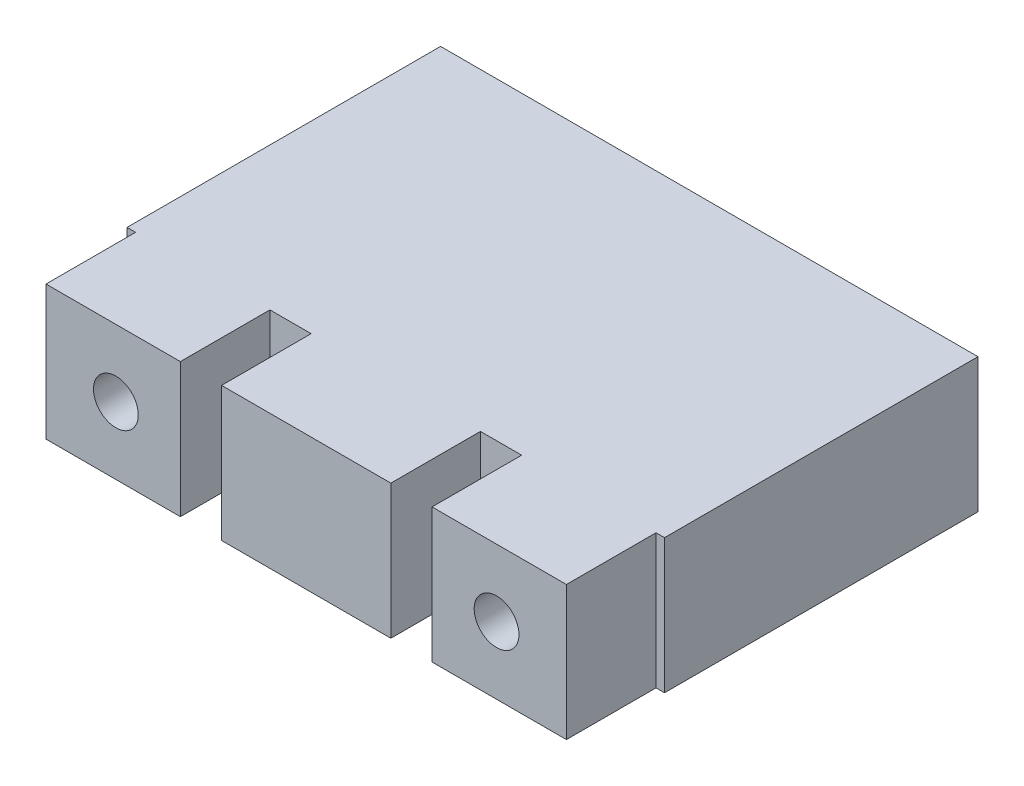
ISO-10303-21;
HEADER;
FILE_DESCRIPTION(('STEP AP214'),'2;1');
FILE_NAME('part.step','',(''),(''),'','','');
FILE_SCHEMA(('AUTOMOTIVE_DESIGN { 1 0 10303 214 1 1 1 1 }'));
ENDSEC;
DATA;
#1=APPLICATION_CONTEXT('core data for automotive mechanical design processes');
#2=APPLICATION_PROTOCOL_DEFINITION('international standard','automotive_design',2000,#1);
#3=PRODUCT_CONTEXT('',#1,'mechanical');
#4=PRODUCT('Part','Part','',(#3));
#5=PRODUCT_RELATED_PRODUCT_CATEGORY('part','',(#4));
#6=PRODUCT_DEFINITION_FORMATION('','',#4);
#7=PRODUCT_DEFINITION_CONTEXT('part definition',#1,'design');
#8=PRODUCT_DEFINITION('design','',#6,#7);
#9=PRODUCT_DEFINITION_SHAPE('','',#8);
#10=(LENGTH_UNIT() NAMED_UNIT(*) SI_UNIT(.MILLI.,.METRE.));
#11=(NAMED_UNIT(*) PLANE_ANGLE_UNIT() SI_UNIT($,.RADIAN.));
#12=(NAMED_UNIT(*) SI_UNIT($,.STERADIAN.) SOLID_ANGLE_UNIT());
#13=UNCERTAINTY_MEASURE_WITH_UNIT(LENGTH_MEASURE(1.E-05),#10,'distance_accuracy_value','');
#14=(GEOMETRIC_REPRESENTATION_CONTEXT(3) GLOBAL_UNCERTAINTY_ASSIGNED_CONTEXT((#13)) GLOBAL_UNIT_ASSIGNED_CONTEXT((#10,
#11,#12)) REPRESENTATION_CONTEXT('',''));
#15=CARTESIAN_POINT('',(0.,0.,0.));
#16=DIRECTION('',(0.,0.,1.));
#17=DIRECTION('',(1.,0.,0.));
#18=AXIS2_PLACEMENT_3D('',#15,#16,#17);
#19=CARTESIAN_POINT('',(0.,0.,-6.35));
#20=DIRECTION('',(0.,0.,1.));
#21=DIRECTION('',(1.,0.,0.));
#22=AXIS2_PLACEMENT_3D('',#19,#20,#21);
#23=PLANE('',#22);
#24=DIRECTION('',(1.,0.,0.));
#25=VECTOR('',#24,1.);
#26=CARTESIAN_POINT('',(-13.04925,9.525,-6.35));
#27=LINE('',#26,#25);
#28=CARTESIAN_POINT('',(24.4475,9.525,-6.35));
#29=VERTEX_POINT('',#28);
#30=CARTESIAN_POINT('',(25.05075,9.525,-6.35));
#31=VERTEX_POINT('',#30);
#32=EDGE_CURVE('E256',#29,#31,#27,.T.);
#33=ORIENTED_EDGE('',*,*,#32,.F.);
#34=DIRECTION('',(0.,1.,0.));
#35=VECTOR('',#34,1.);
#36=CARTESIAN_POINT('',(24.4475,9.525,-6.34999999999764));
#37=LINE('',#36,#35);
#38=CARTESIAN_POINT('',(24.4475,0.,-6.35000000011132));
#39=VERTEX_POINT('',#38);
#40=EDGE_CURVE('E204',#39,#29,#37,.T.);
#41=ORIENTED_EDGE('',*,*,#40,.F.);
#42=DIRECTION('',(-1.,0.,0.));
#43=VECTOR('',#42,1.);
#44=CARTESIAN_POINT('',(-13.04925,0.,-6.35));
#45=LINE('',#44,#43);
#46=CARTESIAN_POINT('',(25.05075,0.,-6.35));
#47=VERTEX_POINT('',#46);
#48=EDGE_CURVE('E247',#47,#39,#45,.T.);
#49=ORIENTED_EDGE('',*,*,#48,.F.);
#50=DIRECTION('',(0.,-1.,0.));
#51=VECTOR('',#50,1.);
#52=CARTESIAN_POINT('',(25.05075,9.525,-6.35));
#53=LINE('',#52,#51);
#54=EDGE_CURVE('E259',#31,#47,#53,.T.);
#55=ORIENTED_EDGE('',*,*,#54,.F.);
#56=EDGE_LOOP('',(#33,#41,#49,#55));
#57=FACE_BOUND('',#56,.T.);
#58=ADVANCED_FACE('F63',(#57),#23,.T.);
#59=DIRECTION('',(0.,1.,0.));
#60=VECTOR('',#59,1.);
#61=CARTESIAN_POINT('',(-12.446,9.525,-6.34999999999764));
#62=LINE('',#61,#60);
#63=CARTESIAN_POINT('',(-12.446,0.,-6.35));
#64=VERTEX_POINT('',#63);
#65=CARTESIAN_POINT('',(-12.446,9.525,-6.35000000011132));
#66=VERTEX_POINT('',#65);
#67=EDGE_CURVE('E211',#64,#66,#62,.T.);
#68=ORIENTED_EDGE('',*,*,#67,.T.);
#69=CARTESIAN_POINT('',(-13.04925,9.525,-6.35));
#70=VERTEX_POINT('',#69);
#71=EDGE_CURVE('E268',#70,#66,#27,.T.);
#72=ORIENTED_EDGE('',*,*,#71,.F.);
#73=DIRECTION('',(0.,1.,0.));
#74=VECTOR('',#73,1.);
#75=CARTESIAN_POINT('',(-13.04925,9.525,-6.35));
#76=LINE('',#75,#74);
#77=CARTESIAN_POINT('',(-13.04925,0.,-6.35));
#78=VERTEX_POINT('',#77);
#79=EDGE_CURVE('E220',#78,#70,#76,.T.);
#80=ORIENTED_EDGE('',*,*,#79,.F.);
#81=EDGE_CURVE('E276',#64,#78,#45,.T.);
#82=ORIENTED_EDGE('',*,*,#81,.F.);
#83=EDGE_LOOP('',(#68,#72,#80,#82));
#84=FACE_BOUND('',#83,.T.);
#85=ADVANCED_FACE('F308',(#84),#23,.T.);
#86=CARTESIAN_POINT('',(0.,9.525,-6.35));
#87=DIRECTION('',(0.,-1.,0.));
#88=DIRECTION('',(0.,0.,-1.));
#89=AXIS2_PLACEMENT_3D('',#86,#87,#88);
#90=PLANE('',#89);
#91=DIRECTION('',(1.,0.,0.));
#92=VECTOR('',#91,1.);
#93=CARTESIAN_POINT('',(0.,9.525,0.));
#94=LINE('',#93,#92);
#95=CARTESIAN_POINT('',(0.,9.525,0.));
#96=VERTEX_POINT('',#95);
#97=CARTESIAN_POINT('',(12.0015,9.525,0.));
#98=VERTEX_POINT('',#97);
#99=EDGE_CURVE('E291',#96,#98,#94,.T.);
#100=ORIENTED_EDGE('',*,*,#99,.T.);
#101=DIRECTION('',(0.,0.,1.));
#102=VECTOR('',#101,1.);
#103=CARTESIAN_POINT('',(12.0015,9.525,-6.35));
#104=LINE('',#103,#102);
#105=CARTESIAN_POINT('',(12.0015,9.525,-6.35));
#106=VERTEX_POINT('',#105);
#107=EDGE_CURVE('E71',#106,#98,#104,.T.);
#108=ORIENTED_EDGE('',*,*,#107,.F.);
#109=CARTESIAN_POINT('',(14.9225,9.525,-6.35000000011132));
#110=VERTEX_POINT('',#109);
#111=EDGE_CURVE('E180',#106,#110,#27,.T.);
#112=ORIENTED_EDGE('',*,*,#111,.T.);
#113=DIRECTION('',(0.,0.,1.));
#114=VECTOR('',#113,1.);
#115=CARTESIAN_POINT('',(14.9225,9.525,-500000.));
#116=LINE('',#115,#114);
#117=CARTESIAN_POINT('',(14.9225,9.525,0.));
#118=VERTEX_POINT('',#117);
#119=EDGE_CURVE('E174',#110,#118,#116,.T.);
#120=ORIENTED_EDGE('',*,*,#119,.T.);
#121=DIRECTION('',(1.,0.,0.));
#122=VECTOR('',#121,1.);
#123=CARTESIAN_POINT('',(14.9225,9.525,0.));
#124=LINE('',#123,#122);
#125=CARTESIAN_POINT('',(24.4475,9.525,0.));
#126=VERTEX_POINT('',#125);
#127=EDGE_CURVE('E177',#118,#126,#124,.T.);
#128=ORIENTED_EDGE('',*,*,#127,.T.);
#129=DIRECTION('',(0.,0.,1.));
#130=VECTOR('',#129,1.);
#131=CARTESIAN_POINT('',(24.4475,9.525,-500000.));
#132=LINE('',#131,#130);
#133=EDGE_CURVE('E78',#29,#126,#132,.T.);
#134=ORIENTED_EDGE('',*,*,#133,.F.);
#135=ORIENTED_EDGE('',*,*,#32,.T.);
#136=DIRECTION('',(0.,0.,1.));
#137=VECTOR('',#136,1.);
#138=CARTESIAN_POINT('',(25.05075,9.525,-28.575));
#139=LINE('',#138,#137);
#140=CARTESIAN_POINT('',(25.05075,9.525,-28.575));
#141=VERTEX_POINT('',#140);
#142=EDGE_CURVE('E292',#141,#31,#139,.T.);
#143=ORIENTED_EDGE('',*,*,#142,.F.);
#144=DIRECTION('',(1.,0.,0.));
#145=VECTOR('',#144,1.);
#146=CARTESIAN_POINT('',(-13.04925,9.525,-28.575));
#147=LINE('',#146,#145);
#148=CARTESIAN_POINT('',(-13.04925,9.525,-28.575));
#149=VERTEX_POINT('',#148);
#150=EDGE_CURVE('E246',#149,#141,#147,.T.);
#151=ORIENTED_EDGE('',*,*,#150,.F.);
#152=DIRECTION('',(0.,0.,1.));
#153=VECTOR('',#152,1.);
#154=CARTESIAN_POINT('',(-13.04925,9.525,-28.575));
#155=LINE('',#154,#153);
#156=EDGE_CURVE('E288',#149,#70,#155,.T.);
#157=ORIENTED_EDGE('',*,*,#156,.T.);
#158=ORIENTED_EDGE('',*,*,#71,.T.);
#159=DIRECTION('',(0.,0.,1.));
#160=VECTOR('',#159,1.);
#161=CARTESIAN_POINT('',(-12.446,9.525,-500000.));
#162=LINE('',#161,#160);
#163=CARTESIAN_POINT('',(-12.446,9.525,0.));
#164=VERTEX_POINT('',#163);
#165=EDGE_CURVE('E235',#66,#164,#162,.T.);
#166=ORIENTED_EDGE('',*,*,#165,.T.);
#167=DIRECTION('',(-1.,0.,0.));
#168=VECTOR('',#167,1.);
#169=CARTESIAN_POINT('',(-2.921,9.525,0.));
#170=LINE('',#169,#168);
#171=CARTESIAN_POINT('',(-2.921,9.525,0.));
#172=VERTEX_POINT('',#171);
#173=EDGE_CURVE('E227',#172,#164,#170,.T.);
#174=ORIENTED_EDGE('',*,*,#173,.F.);
#175=DIRECTION('',(0.,0.,1.));
#176=VECTOR('',#175,1.);
#177=CARTESIAN_POINT('',(-2.921,9.525,-500000.));
#178=LINE('',#177,#176);
#179=CARTESIAN_POINT('',(-2.921,9.525,-6.35000000011132));
#180=VERTEX_POINT('',#179);
#181=EDGE_CURVE('E215',#180,#172,#178,.T.);
#182=ORIENTED_EDGE('',*,*,#181,.F.);
#183=CARTESIAN_POINT('',(0.,9.525,-6.35));
#184=VERTEX_POINT('',#183);
#185=EDGE_CURVE('E271',#180,#184,#27,.T.);
#186=ORIENTED_EDGE('',*,*,#185,.T.);
#187=DIRECTION('',(0.,0.,1.));
#188=VECTOR('',#187,1.);
#189=CARTESIAN_POINT('',(0.,9.525,-6.35));
#190=LINE('',#189,#188);
#191=EDGE_CURVE('E418',#184,#96,#190,.T.);
#192=ORIENTED_EDGE('',*,*,#191,.T.);
#193=EDGE_LOOP('',(#100,#108,#112,#120,#128,#134,#135,#143,#151,#157,#158,#166,#174,#182,#186,#192));
#194=FACE_BOUND('',#193,.T.);
#195=ADVANCED_FACE('F65',(#194),#90,.F.);
#196=CARTESIAN_POINT('',(12.0015,9.525,-6.35));
#197=DIRECTION('',(-1.,0.,0.));
#198=DIRECTION('',(0.,0.,1.));
#199=AXIS2_PLACEMENT_3D('',#196,#197,#198);
#200=PLANE('',#199);
#201=DIRECTION('',(0.,-1.,0.));
#202=VECTOR('',#201,1.);
#203=CARTESIAN_POINT('',(12.0015,9.525,0.));
#204=LINE('',#203,#202);
#205=CARTESIAN_POINT('',(12.0015,0.,0.));
#206=VERTEX_POINT('',#205);
#207=EDGE_CURVE('E413',#98,#206,#204,.T.);
#208=ORIENTED_EDGE('',*,*,#207,.T.);
#209=DIRECTION('',(0.,0.,1.));
#210=VECTOR('',#209,1.);
#211=CARTESIAN_POINT('',(12.0015,0.,-6.35));
#212=LINE('',#211,#210);
#213=CARTESIAN_POINT('',(12.0015,0.,-6.35));
#214=VERTEX_POINT('',#213);
#215=EDGE_CURVE('E429',#214,#206,#212,.T.);
#216=ORIENTED_EDGE('',*,*,#215,.F.);
#217=DIRECTION('',(0.,-1.,0.));
#218=VECTOR('',#217,1.);
#219=CARTESIAN_POINT('',(12.0015,9.525,-6.35));
#220=LINE('',#219,#218);
#221=EDGE_CURVE('E420',#106,#214,#220,.T.);
#222=ORIENTED_EDGE('',*,*,#221,.F.);
#223=ORIENTED_EDGE('',*,*,#107,.T.);
#224=EDGE_LOOP('',(#208,#216,#222,#223));
#225=FACE_BOUND('',#224,.T.);
#226=ADVANCED_FACE('F322',(#225),#200,.F.);
#227=CARTESIAN_POINT('',(0.,0.,-6.35));
#228=DIRECTION('',(0.,-1.,0.));
#229=DIRECTION('',(0.,0.,-1.));
#230=AXIS2_PLACEMENT_3D('',#227,#228,#229);
#231=PLANE('',#230);
#232=DIRECTION('',(1.,0.,0.));
#233=VECTOR('',#232,1.);
#234=CARTESIAN_POINT('',(0.,0.,0.));
#235=LINE('',#234,#233);
#236=CARTESIAN_POINT('',(0.,0.,0.));
#237=VERTEX_POINT('',#236);
#238=EDGE_CURVE('E318',#237,#206,#235,.T.);
#239=ORIENTED_EDGE('',*,*,#238,.F.);
#240=DIRECTION('',(0.,0.,1.));
#241=VECTOR('',#240,1.);
#242=CARTESIAN_POINT('',(0.,0.,-6.35));
#243=LINE('',#242,#241);
#244=CARTESIAN_POINT('',(0.,0.,-6.35));
#245=VERTEX_POINT('',#244);
#246=EDGE_CURVE('E419',#245,#237,#243,.T.);
#247=ORIENTED_EDGE('',*,*,#246,.F.);
#248=CARTESIAN_POINT('',(-2.921,0.,-6.35000000011132));
#249=VERTEX_POINT('',#248);
#250=EDGE_CURVE('E277',#245,#249,#45,.T.);
#251=ORIENTED_EDGE('',*,*,#250,.T.);
#252=DIRECTION('',(0.,0.,1.));
#253=VECTOR('',#252,1.);
#254=CARTESIAN_POINT('',(-2.921,0.,-500000.));
#255=LINE('',#254,#253);
#256=CARTESIAN_POINT('',(-2.921,0.,0.));
#257=VERTEX_POINT('',#256);
#258=EDGE_CURVE('E233',#249,#257,#255,.T.);
#259=ORIENTED_EDGE('',*,*,#258,.T.);
#260=DIRECTION('',(1.,0.,0.));
#261=VECTOR('',#260,1.);
#262=CARTESIAN_POINT('',(-2.921,0.,0.));
#263=LINE('',#262,#261);
#264=CARTESIAN_POINT('',(-12.446,0.,0.));
#265=VERTEX_POINT('',#264);
#266=EDGE_CURVE('E221',#265,#257,#263,.T.);
#267=ORIENTED_EDGE('',*,*,#266,.F.);
#268=DIRECTION('',(0.,0.,1.));
#269=VECTOR('',#268,1.);
#270=CARTESIAN_POINT('',(-12.446,0.,-500000.));
#271=LINE('',#270,#269);
#272=EDGE_CURVE('E86',#64,#265,#271,.T.);
#273=ORIENTED_EDGE('',*,*,#272,.F.);
#274=ORIENTED_EDGE('',*,*,#81,.T.);
#275=DIRECTION('',(0.,0.,1.));
#276=VECTOR('',#275,1.);
#277=CARTESIAN_POINT('',(-13.04925,0.,-28.575));
#278=LINE('',#277,#276);
#279=CARTESIAN_POINT('',(-13.04925,0.,-28.575));
#280=VERTEX_POINT('',#279);
#281=EDGE_CURVE('E253',#280,#78,#278,.T.);
#282=ORIENTED_EDGE('',*,*,#281,.F.);
#283=DIRECTION('',(-1.,0.,0.));
#284=VECTOR('',#283,1.);
#285=CARTESIAN_POINT('',(-13.04925,0.,-28.575));
#286=LINE('',#285,#284);
#287=CARTESIAN_POINT('',(25.05075,0.,-28.575));
#288=VERTEX_POINT('',#287);
#289=EDGE_CURVE('E251',#288,#280,#286,.T.);
#290=ORIENTED_EDGE('',*,*,#289,.F.);
#291=DIRECTION('',(0.,0.,1.));
#292=VECTOR('',#291,1.);
#293=CARTESIAN_POINT('',(25.05075,0.,-28.575));
#294=LINE('',#293,#292);
#295=EDGE_CURVE('E294',#288,#47,#294,.T.);
#296=ORIENTED_EDGE('',*,*,#295,.T.);
#297=ORIENTED_EDGE('',*,*,#48,.T.);
#298=DIRECTION('',(0.,0.,1.));
#299=VECTOR('',#298,1.);
#300=CARTESIAN_POINT('',(24.4475,0.,-500000.));
#301=LINE('',#300,#299);
#302=CARTESIAN_POINT('',(24.4475,0.,0.));
#303=VERTEX_POINT('',#302);
#304=EDGE_CURVE('E205',#39,#303,#301,.T.);
#305=ORIENTED_EDGE('',*,*,#304,.T.);
#306=DIRECTION('',(-1.,0.,0.));
#307=VECTOR('',#306,1.);
#308=CARTESIAN_POINT('',(14.9225,0.,0.));
#309=LINE('',#308,#307);
#310=CARTESIAN_POINT('',(14.9225,0.,0.));
#311=VERTEX_POINT('',#310);
#312=EDGE_CURVE('E198',#303,#311,#309,.T.);
#313=ORIENTED_EDGE('',*,*,#312,.T.);
#314=DIRECTION('',(0.,0.,1.));
#315=VECTOR('',#314,1.);
#316=CARTESIAN_POINT('',(14.9225,0.,-500000.));
#317=LINE('',#316,#315);
#318=CARTESIAN_POINT('',(14.9225,0.,-6.35000000011132));
#319=VERTEX_POINT('',#318);
#320=EDGE_CURVE('E196',#319,#311,#317,.T.);
#321=ORIENTED_EDGE('',*,*,#320,.F.);
#322=EDGE_CURVE('E287',#319,#214,#45,.T.);
#323=ORIENTED_EDGE('',*,*,#322,.T.);
#324=ORIENTED_EDGE('',*,*,#215,.T.);
#325=EDGE_LOOP('',(#239,#247,#251,#259,#267,#273,#274,#282,#290,#296,#297,#305,#313,#321,#323,#324));
#326=FACE_BOUND('',#325,.T.);
#327=ADVANCED_FACE('F315',(#326),#231,.T.);
#328=CARTESIAN_POINT('',(0.,9.525,-6.35));
#329=DIRECTION('',(-1.,0.,0.));
#330=DIRECTION('',(0.,-1.,0.));
#331=AXIS2_PLACEMENT_3D('',#328,#329,#330);
#332=PLANE('',#331);
#333=DIRECTION('',(0.,-1.,0.));
#334=VECTOR('',#333,1.);
#335=CARTESIAN_POINT('',(0.,9.525,0.));
#336=LINE('',#335,#334);
#337=EDGE_CURVE('E411',#96,#237,#336,.T.);
#338=ORIENTED_EDGE('',*,*,#337,.F.);
#339=ORIENTED_EDGE('',*,*,#191,.F.);
#340=DIRECTION('',(0.,-1.,0.));
#341=VECTOR('',#340,1.);
#342=CARTESIAN_POINT('',(0.,9.525,-6.35));
#343=LINE('',#342,#341);
#344=EDGE_CURVE('E423',#184,#245,#343,.T.);
#345=ORIENTED_EDGE('',*,*,#344,.T.);
#346=ORIENTED_EDGE('',*,*,#246,.T.);
#347=EDGE_LOOP('',(#338,#339,#345,#346));
#348=FACE_BOUND('',#347,.T.);
#349=ADVANCED_FACE('F321',(#348),#332,.T.);
#350=CARTESIAN_POINT('',(0.,0.,0.));
#351=DIRECTION('',(0.,0.,-1.));
#352=DIRECTION('',(-1.,0.,0.));
#353=AXIS2_PLACEMENT_3D('',#350,#351,#352);
#354=PLANE('',#353);
#355=ORIENTED_EDGE('',*,*,#99,.F.);
#356=ORIENTED_EDGE('',*,*,#337,.T.);
#357=ORIENTED_EDGE('',*,*,#238,.T.);
#358=ORIENTED_EDGE('',*,*,#207,.F.);
#359=EDGE_LOOP('',(#355,#356,#357,#358));
#360=FACE_BOUND('',#359,.T.);
#361=ADVANCED_FACE('F328',(#360),#354,.F.);
#362=DIRECTION('',(0.,-1.,0.));
#363=VECTOR('',#362,1.);
#364=CARTESIAN_POINT('',(-2.921,9.525,-6.34999999999764));
#365=LINE('',#364,#363);
#366=EDGE_CURVE('E216',#180,#249,#365,.T.);
#367=ORIENTED_EDGE('',*,*,#366,.T.);
#368=ORIENTED_EDGE('',*,*,#250,.F.);
#369=ORIENTED_EDGE('',*,*,#344,.F.);
#370=ORIENTED_EDGE('',*,*,#185,.F.);
#371=EDGE_LOOP('',(#367,#368,#369,#370));
#372=FACE_BOUND('',#371,.T.);
#373=ADVANCED_FACE('F351',(#372),#23,.T.);
#374=CARTESIAN_POINT('',(-13.04925,9.525,-28.575));
#375=DIRECTION('',(1.,0.,0.));
#376=DIRECTION('',(0.,0.,-1.));
#377=AXIS2_PLACEMENT_3D('',#374,#375,#376);
#378=PLANE('',#377);
#379=ORIENTED_EDGE('',*,*,#79,.T.);
#380=ORIENTED_EDGE('',*,*,#156,.F.);
#381=DIRECTION('',(0.,1.,0.));
#382=VECTOR('',#381,1.);
#383=CARTESIAN_POINT('',(-13.04925,9.525,-28.575));
#384=LINE('',#383,#382);
#385=EDGE_CURVE('E243',#280,#149,#384,.T.);
#386=ORIENTED_EDGE('',*,*,#385,.F.);
#387=ORIENTED_EDGE('',*,*,#281,.T.);
#388=EDGE_LOOP('',(#379,#380,#386,#387));
#389=FACE_BOUND('',#388,.T.);
#390=ADVANCED_FACE('F304',(#389),#378,.F.);
#391=CARTESIAN_POINT('',(25.05075,9.525,-28.575));
#392=DIRECTION('',(-1.,0.,0.));
#393=DIRECTION('',(0.,0.,1.));
#394=AXIS2_PLACEMENT_3D('',#391,#392,#393);
#395=PLANE('',#394);
#396=ORIENTED_EDGE('',*,*,#54,.T.);
#397=ORIENTED_EDGE('',*,*,#295,.F.);
#398=DIRECTION('',(0.,-1.,0.));
#399=VECTOR('',#398,1.);
#400=CARTESIAN_POINT('',(25.05075,9.525,-28.575));
#401=LINE('',#400,#399);
#402=EDGE_CURVE('E249',#141,#288,#401,.T.);
#403=ORIENTED_EDGE('',*,*,#402,.F.);
#404=ORIENTED_EDGE('',*,*,#142,.T.);
#405=EDGE_LOOP('',(#396,#397,#403,#404));
#406=FACE_BOUND('',#405,.T.);
#407=ADVANCED_FACE('F360',(#406),#395,.F.);
#408=CARTESIAN_POINT('',(0.,0.,-28.575));
#409=DIRECTION('',(0.,0.,1.));
#410=DIRECTION('',(1.,0.,0.));
#411=AXIS2_PLACEMENT_3D('',#408,#409,#410);
#412=PLANE('',#411);
#413=ORIENTED_EDGE('',*,*,#385,.T.);
#414=ORIENTED_EDGE('',*,*,#150,.T.);
#415=ORIENTED_EDGE('',*,*,#402,.T.);
#416=ORIENTED_EDGE('',*,*,#289,.T.);
#417=EDGE_LOOP('',(#413,#414,#415,#416));
#418=FACE_BOUND('',#417,.T.);
#419=ADVANCED_FACE('F313',(#418),#412,.F.);
#420=ORIENTED_EDGE('',*,*,#322,.F.);
#421=DIRECTION('',(0.,-1.,0.));
#422=VECTOR('',#421,1.);
#423=CARTESIAN_POINT('',(14.9225,9.525,-6.34999999999764));
#424=LINE('',#423,#422);
#425=EDGE_CURVE('E209',#110,#319,#424,.T.);
#426=ORIENTED_EDGE('',*,*,#425,.F.);
#427=ORIENTED_EDGE('',*,*,#111,.F.);
#428=ORIENTED_EDGE('',*,*,#221,.T.);
#429=EDGE_LOOP('',(#420,#426,#427,#428));
#430=FACE_BOUND('',#429,.T.);
#431=ADVANCED_FACE('F336',(#430),#23,.T.);
#432=CARTESIAN_POINT('',(-12.446,9.525,-500000.));
#433=DIRECTION('',(-1.,0.,0.));
#434=DIRECTION('',(0.,0.,1.));
#435=AXIS2_PLACEMENT_3D('',#432,#433,#434);
#436=PLANE('',#435);
#437=ORIENTED_EDGE('',*,*,#67,.F.);
#438=ORIENTED_EDGE('',*,*,#272,.T.);
#439=DIRECTION('',(0.,-1.,0.));
#440=VECTOR('',#439,1.);
#441=CARTESIAN_POINT('',(-12.446,9.525,0.));
#442=LINE('',#441,#440);
#443=EDGE_CURVE('E224',#164,#265,#442,.T.);
#444=ORIENTED_EDGE('',*,*,#443,.F.);
#445=ORIENTED_EDGE('',*,*,#165,.F.);
#446=EDGE_LOOP('',(#437,#438,#444,#445));
#447=FACE_BOUND('',#446,.T.);
#448=ADVANCED_FACE('F349',(#447),#436,.T.);
#449=CARTESIAN_POINT('',(0.,0.,0.));
#450=DIRECTION('',(0.,0.,-1.));
#451=DIRECTION('',(-1.,0.,0.));
#452=AXIS2_PLACEMENT_3D('',#449,#450,#451);
#453=PLANE('',#452);
#454=CARTESIAN_POINT('',(-7.493,4.7625,0.));
#455=DIRECTION('',(0.,0.,1.));
#456=DIRECTION('',(1.,0.,0.));
#457=AXIS2_PLACEMENT_3D('',#454,#455,#456);
#458=CIRCLE('',#457,1.5875);
#459=CARTESIAN_POINT('',(-5.9055,4.7625,0.));
#460=VERTEX_POINT('',#459);
#461=EDGE_CURVE('E230',#460,#460,#458,.T.);
#462=ORIENTED_EDGE('',*,*,#461,.F.);
#463=EDGE_LOOP('',(#462));
#464=FACE_BOUND('',#463,.T.);
#465=DIRECTION('',(0.,1.,0.));
#466=VECTOR('',#465,1.);
#467=CARTESIAN_POINT('',(-2.921,9.525,0.));
#468=LINE('',#467,#466);
#469=EDGE_CURVE('E217',#257,#172,#468,.T.);
#470=ORIENTED_EDGE('',*,*,#469,.T.);
#471=ORIENTED_EDGE('',*,*,#173,.T.);
#472=ORIENTED_EDGE('',*,*,#443,.T.);
#473=ORIENTED_EDGE('',*,*,#266,.T.);
#474=EDGE_LOOP('',(#470,#471,#472,#473));
#475=FACE_BOUND('',#474,.T.);
#476=ADVANCED_FACE('F357',(#464,#475),#453,.F.);
#477=CARTESIAN_POINT('',(-2.921,9.525,-500000.));
#478=DIRECTION('',(1.,0.,0.));
#479=DIRECTION('',(0.,1.,0.));
#480=AXIS2_PLACEMENT_3D('',#477,#478,#479);
#481=PLANE('',#480);
#482=ORIENTED_EDGE('',*,*,#366,.F.);
#483=ORIENTED_EDGE('',*,*,#181,.T.);
#484=ORIENTED_EDGE('',*,*,#469,.F.);
#485=ORIENTED_EDGE('',*,*,#258,.F.);
#486=EDGE_LOOP('',(#482,#483,#484,#485));
#487=FACE_BOUND('',#486,.T.);
#488=ADVANCED_FACE('F365',(#487),#481,.T.);
#489=CARTESIAN_POINT('',(-7.493,4.7625,-500000.));
#490=DIRECTION('',(0.,0.,1.));
#491=DIRECTION('',(1.,0.,0.));
#492=AXIS2_PLACEMENT_3D('',#489,#490,#491);
#493=CYLINDRICAL_SURFACE('',#492,1.5875);
#494=CARTESIAN_POINT('',(-7.493,4.7625,-6.34999999999764));
#495=DIRECTION('',(0.,0.,1.));
#496=DIRECTION('',(1.,0.,0.));
#497=AXIS2_PLACEMENT_3D('',#494,#495,#496);
#498=CIRCLE('',#497,1.5875);
#499=CARTESIAN_POINT('',(-5.9055,4.7625,-6.34999999999764));
#500=VERTEX_POINT('',#499);
#501=EDGE_CURVE('E212',#500,#500,#498,.F.);
#502=ORIENTED_EDGE('',*,*,#501,.T.);
#503=EDGE_LOOP('',(#502));
#504=FACE_BOUND('',#503,.T.);
#505=ORIENTED_EDGE('',*,*,#461,.T.);
#506=EDGE_LOOP('',(#505));
#507=FACE_BOUND('',#506,.T.);
#508=ADVANCED_FACE('F352',(#504,#507),#493,.F.);
#509=ORIENTED_EDGE('',*,*,#501,.F.);
#510=EDGE_LOOP('',(#509));
#511=FACE_BOUND('',#510,.T.);
#512=ADVANCED_FACE('F340',(#511),#23,.T.);
#513=CARTESIAN_POINT('',(24.4475,9.525,-500000.));
#514=DIRECTION('',(-1.,0.,0.));
#515=DIRECTION('',(0.,0.,1.));
#516=AXIS2_PLACEMENT_3D('',#513,#514,#515);
#517=PLANE('',#516);
#518=ORIENTED_EDGE('',*,*,#304,.F.);
#519=ORIENTED_EDGE('',*,*,#40,.T.);
#520=ORIENTED_EDGE('',*,*,#133,.T.);
#521=DIRECTION('',(0.,-1.,0.));
#522=VECTOR('',#521,1.);
#523=CARTESIAN_POINT('',(24.4475,9.525,0.));
#524=LINE('',#523,#522);
#525=EDGE_CURVE('E192',#126,#303,#524,.T.);
#526=ORIENTED_EDGE('',*,*,#525,.T.);
#527=EDGE_LOOP('',(#518,#519,#520,#526));
#528=FACE_BOUND('',#527,.T.);
#529=ADVANCED_FACE('F347',(#528),#517,.F.);
#530=CARTESIAN_POINT('',(12.0015,0.,0.));
#531=DIRECTION('',(0.,0.,-1.));
#532=DIRECTION('',(1.,0.,0.));
#533=AXIS2_PLACEMENT_3D('',#530,#531,#532);
#534=PLANE('',#533);
#535=CARTESIAN_POINT('',(19.4945,4.7625,0.));
#536=DIRECTION('',(0.,0.,-1.));
#537=DIRECTION('',(-1.,0.,0.));
#538=AXIS2_PLACEMENT_3D('',#535,#536,#537);
#539=CIRCLE('',#538,1.5875);
#540=CARTESIAN_POINT('',(17.907,4.7625,0.));
#541=VERTEX_POINT('',#540);
#542=EDGE_CURVE('E184',#541,#541,#539,.T.);
#543=ORIENTED_EDGE('',*,*,#542,.T.);
#544=EDGE_LOOP('',(#543));
#545=FACE_BOUND('',#544,.T.);
#546=DIRECTION('',(0.,1.,0.));
#547=VECTOR('',#546,1.);
#548=CARTESIAN_POINT('',(14.9225,9.525,0.));
#549=LINE('',#548,#547);
#550=EDGE_CURVE('E190',#311,#118,#549,.T.);
#551=ORIENTED_EDGE('',*,*,#550,.F.);
#552=ORIENTED_EDGE('',*,*,#312,.F.);
#553=ORIENTED_EDGE('',*,*,#525,.F.);
#554=ORIENTED_EDGE('',*,*,#127,.F.);
#555=EDGE_LOOP('',(#551,#552,#553,#554));
#556=FACE_BOUND('',#555,.T.);
#557=ADVANCED_FACE('F188',(#545,#556),#534,.F.);
#558=CARTESIAN_POINT('',(14.9225,9.525,-500000.));
#559=DIRECTION('',(1.,0.,0.));
#560=DIRECTION('',(0.,1.,0.));
#561=AXIS2_PLACEMENT_3D('',#558,#559,#560);
#562=PLANE('',#561);
#563=ORIENTED_EDGE('',*,*,#119,.F.);
#564=ORIENTED_EDGE('',*,*,#425,.T.);
#565=ORIENTED_EDGE('',*,*,#320,.T.);
#566=ORIENTED_EDGE('',*,*,#550,.T.);
#567=EDGE_LOOP('',(#563,#564,#565,#566));
#568=FACE_BOUND('',#567,.T.);
#569=ADVANCED_FACE('F194',(#568),#562,.F.);
#570=CARTESIAN_POINT('',(19.4945,4.7625,-500000.));
#571=DIRECTION('',(0.,0.,1.));
#572=DIRECTION('',(1.,0.,0.));
#573=AXIS2_PLACEMENT_3D('',#570,#571,#572);
#574=CYLINDRICAL_SURFACE('',#573,1.5875);
#575=CARTESIAN_POINT('',(19.4945,4.7625,-6.34999999999764));
#576=DIRECTION('',(0.,0.,1.));
#577=DIRECTION('',(1.,0.,0.));
#578=AXIS2_PLACEMENT_3D('',#575,#576,#577);
#579=CIRCLE('',#578,1.5875);
#580=CARTESIAN_POINT('',(21.082,4.7625,-6.34999999999764));
#581=VERTEX_POINT('',#580);
#582=EDGE_CURVE('E12',#581,#581,#579,.F.);
#583=ORIENTED_EDGE('',*,*,#582,.T.);
#584=EDGE_LOOP('',(#583));
#585=FACE_BOUND('',#584,.T.);
#586=ORIENTED_EDGE('',*,*,#542,.F.);
#587=EDGE_LOOP('',(#586));
#588=FACE_BOUND('',#587,.T.);
#589=ADVANCED_FACE('F345',(#585,#588),#574,.F.);
#590=ORIENTED_EDGE('',*,*,#582,.F.);
#591=EDGE_LOOP('',(#590));
#592=FACE_BOUND('',#591,.T.);
#593=ADVANCED_FACE('F335',(#592),#23,.T.);
#594=CLOSED_SHELL('',(#58,#85,#195,#226,#327,#349,#361,#373,#390,#407,#419,#431,#448,#476,#488,
#508,#512,#529,#557,#569,#589,#593));
#595=MANIFOLD_SOLID_BREP('B2',#594);
#596=ADVANCED_BREP_SHAPE_REPRESENTATION('',(#18,#595),#14);
#597=SHAPE_DEFINITION_REPRESENTATION(#9,#596);
ENDSEC;
END-ISO-10303-21;
